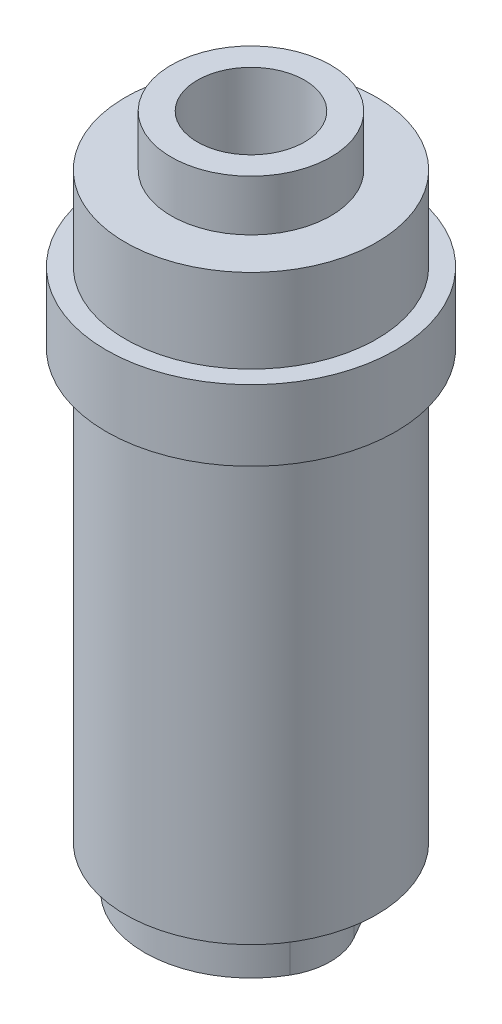
ISO-10303-21;
HEADER;
FILE_DESCRIPTION(('STEP AP214'),'2;1');
FILE_NAME('part.step','',(''),(''),'','','');
FILE_SCHEMA(('AUTOMOTIVE_DESIGN { 1 0 10303 214 1 1 1 1 }'));
ENDSEC;
DATA;
#1=APPLICATION_CONTEXT('core data for automotive mechanical design processes');
#2=APPLICATION_PROTOCOL_DEFINITION('international standard','automotive_design',2000,#1);
#3=PRODUCT_CONTEXT('',#1,'mechanical');
#4=PRODUCT('Part','Part','',(#3));
#5=PRODUCT_RELATED_PRODUCT_CATEGORY('part','',(#4));
#6=PRODUCT_DEFINITION_FORMATION('','',#4);
#7=PRODUCT_DEFINITION_CONTEXT('part definition',#1,'design');
#8=PRODUCT_DEFINITION('design','',#6,#7);
#9=PRODUCT_DEFINITION_SHAPE('','',#8);
#10=(LENGTH_UNIT() NAMED_UNIT(*) SI_UNIT(.MILLI.,.METRE.));
#11=(NAMED_UNIT(*) PLANE_ANGLE_UNIT() SI_UNIT($,.RADIAN.));
#12=(NAMED_UNIT(*) SI_UNIT($,.STERADIAN.) SOLID_ANGLE_UNIT());
#13=UNCERTAINTY_MEASURE_WITH_UNIT(LENGTH_MEASURE(1.E-05),#10,'distance_accuracy_value','');
#14=(GEOMETRIC_REPRESENTATION_CONTEXT(3) GLOBAL_UNCERTAINTY_ASSIGNED_CONTEXT((#13)) GLOBAL_UNIT_ASSIGNED_CONTEXT((#10,
#11,#12)) REPRESENTATION_CONTEXT('',''));
#15=CARTESIAN_POINT('',(0.,0.,0.));
#16=DIRECTION('',(0.,0.,1.));
#17=DIRECTION('',(1.,0.,0.));
#18=AXIS2_PLACEMENT_3D('',#15,#16,#17);
#19=CARTESIAN_POINT('',(-7.449199986,0.,0.));
#20=DIRECTION('',(0.,1.,0.));
#21=DIRECTION('',(1.,0.,0.));
#22=AXIS2_PLACEMENT_3D('',#19,#20,#21);
#23=PLANE('',#22);
#24=CARTESIAN_POINT('',(0.,0.,0.));
#25=DIRECTION('',(0.,-1.,0.));
#26=DIRECTION('',(0.,0.,-1.));
#27=AXIS2_PLACEMENT_3D('',#24,#25,#26);
#28=CIRCLE('',#27,3.2639);
#29=CARTESIAN_POINT('',(0.,0.,-3.2639));
#30=VERTEX_POINT('',#29);
#31=EDGE_CURVE('E187',#30,#30,#28,.T.);
#32=ORIENTED_EDGE('',*,*,#31,.F.);
#33=EDGE_LOOP('',(#32));
#34=FACE_BOUND('',#33,.T.);
#35=CARTESIAN_POINT('',(0.,0.,-2.54));
#36=DIRECTION('',(0.,-1.,0.));
#37=DIRECTION('',(0.,0.,-1.));
#38=AXIS2_PLACEMENT_3D('',#35,#36,#37);
#39=CIRCLE('',#38,3.81);
#40=CARTESIAN_POINT('',(-3.29955678841871,0.,-4.445));
#41=VERTEX_POINT('',#40);
#42=CARTESIAN_POINT('',(3.29955678841871,0.,-4.445));
#43=VERTEX_POINT('',#42);
#44=EDGE_CURVE('E74',#41,#43,#39,.T.);
#45=ORIENTED_EDGE('',*,*,#44,.T.);
#46=DIRECTION('',(0.5,0.,0.866025403784439));
#47=VECTOR('',#46,1.);
#48=CARTESIAN_POINT('',(3.29955678841871,0.,-4.445));
#49=LINE('',#48,#47);
#50=CARTESIAN_POINT('',(5.49926131403119,0.,-0.635));
#51=VERTEX_POINT('',#50);
#52=EDGE_CURVE('E11',#43,#51,#49,.T.);
#53=ORIENTED_EDGE('',*,*,#52,.T.);
#54=CARTESIAN_POINT('',(2.19970452561247,0.,1.27));
#55=DIRECTION('',(0.,-1.,0.));
#56=DIRECTION('',(0.,0.,-1.));
#57=AXIS2_PLACEMENT_3D('',#54,#55,#56);
#58=CIRCLE('',#57,3.81);
#59=CARTESIAN_POINT('',(5.49926131403119,0.,3.175));
#60=VERTEX_POINT('',#59);
#61=EDGE_CURVE('E46',#51,#60,#58,.T.);
#62=ORIENTED_EDGE('',*,*,#61,.T.);
#63=CARTESIAN_POINT('',(0.,0.,0.));
#64=DIRECTION('',(0.,-1.,0.));
#65=DIRECTION('',(0.,0.,-1.));
#66=AXIS2_PLACEMENT_3D('',#63,#64,#65);
#67=CIRCLE('',#66,6.35);
#68=CARTESIAN_POINT('',(-5.49926131403119,0.,3.175));
#69=VERTEX_POINT('',#68);
#70=EDGE_CURVE('E104',#60,#69,#67,.T.);
#71=ORIENTED_EDGE('',*,*,#70,.T.);
#72=CARTESIAN_POINT('',(-2.19970452561247,0.,1.27));
#73=DIRECTION('',(0.,-1.,0.));
#74=DIRECTION('',(0.,0.,-1.));
#75=AXIS2_PLACEMENT_3D('',#72,#73,#74);
#76=CIRCLE('',#75,3.81);
#77=CARTESIAN_POINT('',(-5.49926131403119,0.,-0.635));
#78=VERTEX_POINT('',#77);
#79=EDGE_CURVE('E85',#69,#78,#76,.T.);
#80=ORIENTED_EDGE('',*,*,#79,.T.);
#81=DIRECTION('',(0.5,0.,-0.866025403784439));
#82=VECTOR('',#81,1.);
#83=CARTESIAN_POINT('',(-5.49926131403119,0.,-0.635));
#84=LINE('',#83,#82);
#85=EDGE_CURVE('E160',#78,#41,#84,.T.);
#86=ORIENTED_EDGE('',*,*,#85,.T.);
#87=EDGE_LOOP('',(#45,#53,#62,#71,#80,#86));
#88=FACE_BOUND('',#87,.T.);
#89=ADVANCED_FACE('F16',(#34,#88),#23,.F.);
#90=CARTESIAN_POINT('',(-2.5527,6.35,0.));
#91=DIRECTION('',(0.,1.,0.));
#92=DIRECTION('',(1.,0.,0.));
#93=AXIS2_PLACEMENT_3D('',#90,#91,#92);
#94=PLANE('',#93);
#95=CARTESIAN_POINT('',(0.,6.35,0.));
#96=DIRECTION('',(0.,-1.,0.));
#97=DIRECTION('',(0.,0.,-1.));
#98=AXIS2_PLACEMENT_3D('',#95,#96,#97);
#99=CIRCLE('',#98,2.5527);
#100=CARTESIAN_POINT('',(0.,6.35,-2.5527));
#101=VERTEX_POINT('',#100);
#102=EDGE_CURVE('E200',#101,#101,#99,.T.);
#103=ORIENTED_EDGE('',*,*,#102,.F.);
#104=EDGE_LOOP('',(#103));
#105=FACE_BOUND('',#104,.T.);
#106=CARTESIAN_POINT('',(0.,6.35,0.));
#107=DIRECTION('',(0.,-1.,0.));
#108=DIRECTION('',(0.,0.,-1.));
#109=AXIS2_PLACEMENT_3D('',#106,#107,#108);
#110=CIRCLE('',#109,3.2639);
#111=CARTESIAN_POINT('',(0.,6.35,-3.2639));
#112=VERTEX_POINT('',#111);
#113=EDGE_CURVE('E195',#112,#112,#110,.T.);
#114=ORIENTED_EDGE('',*,*,#113,.T.);
#115=EDGE_LOOP('',(#114));
#116=FACE_BOUND('',#115,.T.);
#117=ADVANCED_FACE('F177',(#105,#116),#94,.F.);
#118=CARTESIAN_POINT('',(3.29955678841871,23.6095192980614,-4.445));
#119=DIRECTION('',(0.866025403784439,0.,-0.5));
#120=DIRECTION('',(0.,-1.,0.));
#121=AXIS2_PLACEMENT_3D('',#118,#119,#120);
#122=PLANE('',#121);
#123=DIRECTION('',(0.5,0.,0.866025403784439));
#124=VECTOR('',#123,1.);
#125=CARTESIAN_POINT('',(3.29955678841871,2.54,-4.445));
#126=LINE('',#125,#124);
#127=CARTESIAN_POINT('',(3.29955678841871,2.54,-4.445));
#128=VERTEX_POINT('',#127);
#129=CARTESIAN_POINT('',(5.49926131403119,2.54,-0.635));
#130=VERTEX_POINT('',#129);
#131=EDGE_CURVE('E155',#128,#130,#126,.T.);
#132=ORIENTED_EDGE('',*,*,#131,.T.);
#133=DIRECTION('',(0.,-1.,0.));
#134=VECTOR('',#133,1.);
#135=CARTESIAN_POINT('',(5.49926131403119,23.6095192980614,-0.635));
#136=LINE('',#135,#134);
#137=EDGE_CURVE('E24',#130,#51,#136,.T.);
#138=ORIENTED_EDGE('',*,*,#137,.T.);
#139=ORIENTED_EDGE('',*,*,#52,.F.);
#140=DIRECTION('',(0.,-1.,0.));
#141=VECTOR('',#140,1.);
#142=CARTESIAN_POINT('',(3.29955678841871,23.6095192980614,-4.445));
#143=LINE('',#142,#141);
#144=EDGE_CURVE('E156',#128,#43,#143,.T.);
#145=ORIENTED_EDGE('',*,*,#144,.F.);
#146=EDGE_LOOP('',(#132,#138,#139,#145));
#147=FACE_BOUND('',#146,.T.);
#148=ADVANCED_FACE('F172',(#147),#122,.T.);
#149=CARTESIAN_POINT('',(2.19970452561247,23.6095192980614,1.27));
#150=DIRECTION('',(0.,-1.,0.));
#151=DIRECTION('',(0.,0.,-1.));
#152=AXIS2_PLACEMENT_3D('',#149,#150,#151);
#153=CYLINDRICAL_SURFACE('',#152,3.81);
#154=CARTESIAN_POINT('',(2.19970452561247,2.54,1.27));
#155=DIRECTION('',(0.,-1.,0.));
#156=DIRECTION('',(0.,0.,1.));
#157=AXIS2_PLACEMENT_3D('',#154,#155,#156);
#158=CIRCLE('',#157,3.81);
#159=CARTESIAN_POINT('',(5.49926131403119,2.54,3.175));
#160=VERTEX_POINT('',#159);
#161=EDGE_CURVE('E113',#130,#160,#158,.T.);
#162=ORIENTED_EDGE('',*,*,#161,.T.);
#163=DIRECTION('',(0.,-1.,0.));
#164=VECTOR('',#163,1.);
#165=CARTESIAN_POINT('',(5.49926131403119,23.6095192980614,3.175));
#166=LINE('',#165,#164);
#167=EDGE_CURVE('E109',#160,#60,#166,.T.);
#168=ORIENTED_EDGE('',*,*,#167,.T.);
#169=ORIENTED_EDGE('',*,*,#61,.F.);
#170=ORIENTED_EDGE('',*,*,#137,.F.);
#171=EDGE_LOOP('',(#162,#168,#169,#170));
#172=FACE_BOUND('',#171,.T.);
#173=ADVANCED_FACE('F180',(#172),#153,.T.);
#174=CARTESIAN_POINT('',(0.,23.6095192980614,0.));
#175=DIRECTION('',(0.,-1.,0.));
#176=DIRECTION('',(0.,0.,-1.));
#177=AXIS2_PLACEMENT_3D('',#174,#175,#176);
#178=CYLINDRICAL_SURFACE('',#177,6.35);
#179=CARTESIAN_POINT('',(0.,2.54,0.));
#180=DIRECTION('',(0.,-1.,0.));
#181=DIRECTION('',(0.,0.,1.));
#182=AXIS2_PLACEMENT_3D('',#179,#180,#181);
#183=CIRCLE('',#182,6.35);
#184=CARTESIAN_POINT('',(-5.49926131403119,2.54,3.175));
#185=VERTEX_POINT('',#184);
#186=EDGE_CURVE('E107',#160,#185,#183,.T.);
#187=ORIENTED_EDGE('',*,*,#186,.T.);
#188=DIRECTION('',(0.,-1.,0.));
#189=VECTOR('',#188,1.);
#190=CARTESIAN_POINT('',(-5.49926131403119,23.6095192980614,3.175));
#191=LINE('',#190,#189);
#192=EDGE_CURVE('E96',#185,#69,#191,.T.);
#193=ORIENTED_EDGE('',*,*,#192,.T.);
#194=ORIENTED_EDGE('',*,*,#70,.F.);
#195=ORIENTED_EDGE('',*,*,#167,.F.);
#196=EDGE_LOOP('',(#187,#193,#194,#195));
#197=FACE_BOUND('',#196,.T.);
#198=ADVANCED_FACE('F108',(#197),#178,.T.);
#199=CARTESIAN_POINT('',(-2.19970452561247,23.6095192980614,1.27));
#200=DIRECTION('',(0.,-1.,0.));
#201=DIRECTION('',(0.,0.,-1.));
#202=AXIS2_PLACEMENT_3D('',#199,#200,#201);
#203=CYLINDRICAL_SURFACE('',#202,3.81);
#204=CARTESIAN_POINT('',(-2.19970452561247,2.54,1.27));
#205=DIRECTION('',(0.,-1.,0.));
#206=DIRECTION('',(0.,0.,1.));
#207=AXIS2_PLACEMENT_3D('',#204,#205,#206);
#208=CIRCLE('',#207,3.81);
#209=CARTESIAN_POINT('',(-5.49926131403119,2.54,-0.635));
#210=VERTEX_POINT('',#209);
#211=EDGE_CURVE('E99',#185,#210,#208,.T.);
#212=ORIENTED_EDGE('',*,*,#211,.T.);
#213=DIRECTION('',(0.,-1.,0.));
#214=VECTOR('',#213,1.);
#215=CARTESIAN_POINT('',(-5.49926131403119,23.6095192980614,-0.635));
#216=LINE('',#215,#214);
#217=EDGE_CURVE('E159',#210,#78,#216,.T.);
#218=ORIENTED_EDGE('',*,*,#217,.T.);
#219=ORIENTED_EDGE('',*,*,#79,.F.);
#220=ORIENTED_EDGE('',*,*,#192,.F.);
#221=EDGE_LOOP('',(#212,#218,#219,#220));
#222=FACE_BOUND('',#221,.T.);
#223=ADVANCED_FACE('F98',(#222),#203,.T.);
#224=CARTESIAN_POINT('',(-5.49926131403119,23.6095192980614,-0.635));
#225=DIRECTION('',(-0.866025403784439,0.,-0.5));
#226=DIRECTION('',(-0.5,0.,0.866025403784439));
#227=AXIS2_PLACEMENT_3D('',#224,#225,#226);
#228=PLANE('',#227);
#229=DIRECTION('',(0.5,0.,-0.866025403784439));
#230=VECTOR('',#229,1.);
#231=CARTESIAN_POINT('',(-5.49926131403119,2.54,-0.635));
#232=LINE('',#231,#230);
#233=CARTESIAN_POINT('',(-3.29955678841871,2.54,-4.445));
#234=VERTEX_POINT('',#233);
#235=EDGE_CURVE('E120',#210,#234,#232,.T.);
#236=ORIENTED_EDGE('',*,*,#235,.T.);
#237=DIRECTION('',(0.,-1.,0.));
#238=VECTOR('',#237,1.);
#239=CARTESIAN_POINT('',(-3.29955678841871,23.6095192980614,-4.445));
#240=LINE('',#239,#238);
#241=EDGE_CURVE('E206',#234,#41,#240,.T.);
#242=ORIENTED_EDGE('',*,*,#241,.T.);
#243=ORIENTED_EDGE('',*,*,#85,.F.);
#244=ORIENTED_EDGE('',*,*,#217,.F.);
#245=EDGE_LOOP('',(#236,#242,#243,#244));
#246=FACE_BOUND('',#245,.T.);
#247=ADVANCED_FACE('F242',(#246),#228,.T.);
#248=CARTESIAN_POINT('',(-4.7625,37.285900282,0.));
#249=DIRECTION('',(0.,-1.,0.));
#250=DIRECTION('',(0.,0.,-1.));
#251=AXIS2_PLACEMENT_3D('',#248,#249,#250);
#252=PLANE('',#251);
#253=CARTESIAN_POINT('',(0.,37.285900282,0.));
#254=DIRECTION('',(0.,-1.,0.));
#255=DIRECTION('',(0.,0.,-1.));
#256=AXIS2_PLACEMENT_3D('',#253,#254,#255);
#257=CIRCLE('',#256,4.7625);
#258=CARTESIAN_POINT('',(0.,37.285900282,-4.7625));
#259=VERTEX_POINT('',#258);
#260=EDGE_CURVE('E126',#259,#259,#257,.T.);
#261=ORIENTED_EDGE('',*,*,#260,.T.);
#262=EDGE_LOOP('',(#261));
#263=FACE_BOUND('',#262,.T.);
#264=CARTESIAN_POINT('',(0.,37.285900282,0.));
#265=DIRECTION('',(0.,-1.,0.));
#266=DIRECTION('',(0.,0.,-1.));
#267=AXIS2_PLACEMENT_3D('',#264,#265,#266);
#268=CIRCLE('',#267,7.499999986);
#269=CARTESIAN_POINT('',(0.,37.285900282,-7.499999986));
#270=VERTEX_POINT('',#269);
#271=EDGE_CURVE('E212',#270,#270,#268,.T.);
#272=ORIENTED_EDGE('',*,*,#271,.F.);
#273=EDGE_LOOP('',(#272));
#274=FACE_BOUND('',#273,.T.);
#275=ADVANCED_FACE('F582',(#263,#274),#252,.F.);
#276=CARTESIAN_POINT('',(-8.636,32.285900376,0.));
#277=DIRECTION('',(0.,-1.,0.));
#278=DIRECTION('',(0.,0.,-1.));
#279=AXIS2_PLACEMENT_3D('',#276,#277,#278);
#280=PLANE('',#279);
#281=CARTESIAN_POINT('',(0.,32.285900376,0.));
#282=DIRECTION('',(0.,-1.,0.));
#283=DIRECTION('',(0.,0.,-1.));
#284=AXIS2_PLACEMENT_3D('',#281,#282,#283);
#285=CIRCLE('',#284,7.499999986);
#286=CARTESIAN_POINT('',(0.,32.285900376,-7.499999986));
#287=VERTEX_POINT('',#286);
#288=EDGE_CURVE('E219',#287,#287,#285,.T.);
#289=ORIENTED_EDGE('',*,*,#288,.T.);
#290=EDGE_LOOP('',(#289));
#291=FACE_BOUND('',#290,.T.);
#292=CARTESIAN_POINT('',(0.,32.285900376,0.));
#293=DIRECTION('',(0.,-1.,0.));
#294=DIRECTION('',(0.,0.,-1.));
#295=AXIS2_PLACEMENT_3D('',#292,#293,#294);
#296=CIRCLE('',#295,8.636);
#297=CARTESIAN_POINT('',(0.,32.285900376,-8.636));
#298=VERTEX_POINT('',#297);
#299=EDGE_CURVE('E221',#298,#298,#296,.T.);
#300=ORIENTED_EDGE('',*,*,#299,.F.);
#301=EDGE_LOOP('',(#300));
#302=FACE_BOUND('',#301,.T.);
#303=ADVANCED_FACE('F531',(#291,#302),#280,.F.);
#304=CARTESIAN_POINT('',(-8.636,28.067,0.));
#305=DIRECTION('',(0.,1.,0.));
#306=DIRECTION('',(1.,0.,0.));
#307=AXIS2_PLACEMENT_3D('',#304,#305,#306);
#308=PLANE('',#307);
#309=CARTESIAN_POINT('',(0.,28.067,0.));
#310=DIRECTION('',(0.,-1.,0.));
#311=DIRECTION('',(0.,0.,-1.));
#312=AXIS2_PLACEMENT_3D('',#309,#310,#311);
#313=CIRCLE('',#312,7.499999986);
#314=CARTESIAN_POINT('',(0.,28.067,-7.499999986));
#315=VERTEX_POINT('',#314);
#316=EDGE_CURVE('E235',#315,#315,#313,.T.);
#317=ORIENTED_EDGE('',*,*,#316,.F.);
#318=EDGE_LOOP('',(#317));
#319=FACE_BOUND('',#318,.T.);
#320=CARTESIAN_POINT('',(0.,28.067,0.));
#321=DIRECTION('',(0.,-1.,0.));
#322=DIRECTION('',(0.,0.,-1.));
#323=AXIS2_PLACEMENT_3D('',#320,#321,#322);
#324=CIRCLE('',#323,8.636);
#325=CARTESIAN_POINT('',(0.,28.067,-8.636));
#326=VERTEX_POINT('',#325);
#327=EDGE_CURVE('E229',#326,#326,#324,.T.);
#328=ORIENTED_EDGE('',*,*,#327,.T.);
#329=EDGE_LOOP('',(#328));
#330=FACE_BOUND('',#329,.T.);
#331=ADVANCED_FACE('F530',(#319,#330),#308,.F.);
#332=CARTESIAN_POINT('',(-7.499999986,2.54,0.));
#333=DIRECTION('',(0.,1.,0.));
#334=DIRECTION('',(1.,0.,0.));
#335=AXIS2_PLACEMENT_3D('',#332,#333,#334);
#336=PLANE('',#335);
#337=ORIENTED_EDGE('',*,*,#235,.F.);
#338=ORIENTED_EDGE('',*,*,#211,.F.);
#339=ORIENTED_EDGE('',*,*,#186,.F.);
#340=ORIENTED_EDGE('',*,*,#161,.F.);
#341=ORIENTED_EDGE('',*,*,#131,.F.);
#342=CARTESIAN_POINT('',(0.,2.54,-2.54));
#343=DIRECTION('',(0.,-1.,0.));
#344=DIRECTION('',(0.,0.,1.));
#345=AXIS2_PLACEMENT_3D('',#342,#343,#344);
#346=CIRCLE('',#345,3.81);
#347=EDGE_CURVE('E210',#234,#128,#346,.T.);
#348=ORIENTED_EDGE('',*,*,#347,.F.);
#349=EDGE_LOOP('',(#337,#338,#339,#340,#341,#348));
#350=FACE_BOUND('',#349,.T.);
#351=CARTESIAN_POINT('',(0.,2.54,0.));
#352=DIRECTION('',(0.,-1.,0.));
#353=DIRECTION('',(0.,0.,-1.));
#354=AXIS2_PLACEMENT_3D('',#351,#352,#353);
#355=CIRCLE('',#354,7.499999986);
#356=CARTESIAN_POINT('',(0.,2.54,-7.499999986));
#357=VERTEX_POINT('',#356);
#358=EDGE_CURVE('E131',#357,#357,#355,.T.);
#359=ORIENTED_EDGE('',*,*,#358,.T.);
#360=EDGE_LOOP('',(#359));
#361=FACE_BOUND('',#360,.T.);
#362=ADVANCED_FACE('F117',(#350,#361),#336,.F.);
#363=CARTESIAN_POINT('',(-3.2004,27.621700408,0.));
#364=DIRECTION('',(0.,-1.,0.));
#365=DIRECTION('',(0.,0.,-1.));
#366=AXIS2_PLACEMENT_3D('',#363,#364,#365);
#367=PLANE('',#366);
#368=CARTESIAN_POINT('',(0.,27.621700408,0.));
#369=DIRECTION('',(0.,-1.,0.));
#370=DIRECTION('',(0.,0.,-1.));
#371=AXIS2_PLACEMENT_3D('',#368,#369,#370);
#372=CIRCLE('',#371,2.5527);
#373=CARTESIAN_POINT('',(0.,27.621700408,-2.5527));
#374=VERTEX_POINT('',#373);
#375=EDGE_CURVE('E191',#374,#374,#372,.T.);
#376=ORIENTED_EDGE('',*,*,#375,.T.);
#377=EDGE_LOOP('',(#376));
#378=FACE_BOUND('',#377,.T.);
#379=CARTESIAN_POINT('',(0.,27.621700408,0.));
#380=DIRECTION('',(0.,-1.,0.));
#381=DIRECTION('',(0.,0.,-1.));
#382=AXIS2_PLACEMENT_3D('',#379,#380,#381);
#383=CIRCLE('',#382,3.2004);
#384=CARTESIAN_POINT('',(0.,27.621700408,-3.2004));
#385=VERTEX_POINT('',#384);
#386=EDGE_CURVE('E140',#385,#385,#383,.T.);
#387=ORIENTED_EDGE('',*,*,#386,.F.);
#388=EDGE_LOOP('',(#387));
#389=FACE_BOUND('',#388,.T.);
#390=ADVANCED_FACE('F553',(#378,#389),#367,.F.);
#391=CARTESIAN_POINT('',(-4.7625,40.321700408,0.));
#392=DIRECTION('',(0.,-1.,0.));
#393=DIRECTION('',(0.,0.,-1.));
#394=AXIS2_PLACEMENT_3D('',#391,#392,#393);
#395=PLANE('',#394);
#396=CARTESIAN_POINT('',(0.,40.321700408,0.));
#397=DIRECTION('',(0.,-1.,0.));
#398=DIRECTION('',(0.,0.,-1.));
#399=AXIS2_PLACEMENT_3D('',#396,#397,#398);
#400=CIRCLE('',#399,3.2004);
#401=CARTESIAN_POINT('',(0.,40.321700408,-3.2004));
#402=VERTEX_POINT('',#401);
#403=EDGE_CURVE('E132',#402,#402,#400,.T.);
#404=ORIENTED_EDGE('',*,*,#403,.T.);
#405=EDGE_LOOP('',(#404));
#406=FACE_BOUND('',#405,.T.);
#407=CARTESIAN_POINT('',(0.,40.321700408,0.));
#408=DIRECTION('',(0.,-1.,0.));
#409=DIRECTION('',(0.,0.,-1.));
#410=AXIS2_PLACEMENT_3D('',#407,#408,#409);
#411=CIRCLE('',#410,4.7625);
#412=CARTESIAN_POINT('',(0.,40.321700408,-4.7625));
#413=VERTEX_POINT('',#412);
#414=EDGE_CURVE('E143',#413,#413,#411,.T.);
#415=ORIENTED_EDGE('',*,*,#414,.F.);
#416=EDGE_LOOP('',(#415));
#417=FACE_BOUND('',#416,.T.);
#418=ADVANCED_FACE('F297',(#406,#417),#395,.F.);
#419=CARTESIAN_POINT('',(0.,19.05,0.));
#420=DIRECTION('',(0.,-1.,0.));
#421=DIRECTION('',(0.,0.,-1.));
#422=AXIS2_PLACEMENT_3D('',#419,#420,#421);
#423=CYLINDRICAL_SURFACE('',#422,4.7625);
#424=ORIENTED_EDGE('',*,*,#260,.F.);
#425=EDGE_LOOP('',(#424));
#426=FACE_BOUND('',#425,.T.);
#427=ORIENTED_EDGE('',*,*,#414,.T.);
#428=EDGE_LOOP('',(#427));
#429=FACE_BOUND('',#428,.T.);
#430=ADVANCED_FACE('F295',(#426,#429),#423,.T.);
#431=CARTESIAN_POINT('',(0.,19.05,0.));
#432=DIRECTION('',(0.,-1.,0.));
#433=DIRECTION('',(0.,0.,-1.));
#434=AXIS2_PLACEMENT_3D('',#431,#432,#433);
#435=CYLINDRICAL_SURFACE('',#434,3.2004);
#436=ORIENTED_EDGE('',*,*,#386,.T.);
#437=EDGE_LOOP('',(#436));
#438=FACE_BOUND('',#437,.T.);
#439=ORIENTED_EDGE('',*,*,#403,.F.);
#440=EDGE_LOOP('',(#439));
#441=FACE_BOUND('',#440,.T.);
#442=ADVANCED_FACE('F300',(#438,#441),#435,.F.);
#443=CARTESIAN_POINT('',(0.,19.05,0.));
#444=DIRECTION('',(0.,-1.,0.));
#445=DIRECTION('',(0.,0.,-1.));
#446=AXIS2_PLACEMENT_3D('',#443,#444,#445);
#447=CYLINDRICAL_SURFACE('',#446,7.499999986);
#448=ORIENTED_EDGE('',*,*,#358,.F.);
#449=EDGE_LOOP('',(#448));
#450=FACE_BOUND('',#449,.T.);
#451=ORIENTED_EDGE('',*,*,#316,.T.);
#452=EDGE_LOOP('',(#451));
#453=FACE_BOUND('',#452,.T.);
#454=ADVANCED_FACE('F311',(#450,#453),#447,.T.);
#455=CARTESIAN_POINT('',(0.,19.05,0.));
#456=DIRECTION('',(0.,-1.,0.));
#457=DIRECTION('',(0.,0.,-1.));
#458=AXIS2_PLACEMENT_3D('',#455,#456,#457);
#459=CYLINDRICAL_SURFACE('',#458,8.636);
#460=ORIENTED_EDGE('',*,*,#327,.F.);
#461=EDGE_LOOP('',(#460));
#462=FACE_BOUND('',#461,.T.);
#463=ORIENTED_EDGE('',*,*,#299,.T.);
#464=EDGE_LOOP('',(#463));
#465=FACE_BOUND('',#464,.T.);
#466=ADVANCED_FACE('F324',(#462,#465),#459,.T.);
#467=CARTESIAN_POINT('',(0.,19.05,0.));
#468=DIRECTION('',(0.,-1.,0.));
#469=DIRECTION('',(0.,0.,-1.));
#470=AXIS2_PLACEMENT_3D('',#467,#468,#469);
#471=CYLINDRICAL_SURFACE('',#470,7.499999986);
#472=ORIENTED_EDGE('',*,*,#288,.F.);
#473=EDGE_LOOP('',(#472));
#474=FACE_BOUND('',#473,.T.);
#475=ORIENTED_EDGE('',*,*,#271,.T.);
#476=EDGE_LOOP('',(#475));
#477=FACE_BOUND('',#476,.T.);
#478=ADVANCED_FACE('F337',(#474,#477),#471,.T.);
#479=CARTESIAN_POINT('',(0.,23.6095192980614,-2.54));
#480=DIRECTION('',(0.,-1.,0.));
#481=DIRECTION('',(0.,0.,-1.));
#482=AXIS2_PLACEMENT_3D('',#479,#480,#481);
#483=CYLINDRICAL_SURFACE('',#482,3.81);
#484=ORIENTED_EDGE('',*,*,#347,.T.);
#485=ORIENTED_EDGE('',*,*,#144,.T.);
#486=ORIENTED_EDGE('',*,*,#44,.F.);
#487=ORIENTED_EDGE('',*,*,#241,.F.);
#488=EDGE_LOOP('',(#484,#485,#486,#487));
#489=FACE_BOUND('',#488,.T.);
#490=ADVANCED_FACE('F237',(#489),#483,.T.);
#491=CARTESIAN_POINT('',(0.,19.05,0.));
#492=DIRECTION('',(0.,-1.,0.));
#493=DIRECTION('',(0.,0.,-1.));
#494=AXIS2_PLACEMENT_3D('',#491,#492,#493);
#495=CYLINDRICAL_SURFACE('',#494,2.5527);
#496=ORIENTED_EDGE('',*,*,#102,.T.);
#497=EDGE_LOOP('',(#496));
#498=FACE_BOUND('',#497,.T.);
#499=ORIENTED_EDGE('',*,*,#375,.F.);
#500=EDGE_LOOP('',(#499));
#501=FACE_BOUND('',#500,.T.);
#502=ADVANCED_FACE('F359',(#498,#501),#495,.F.);
#503=CARTESIAN_POINT('',(0.,19.05,0.));
#504=DIRECTION('',(0.,-1.,0.));
#505=DIRECTION('',(0.,0.,-1.));
#506=AXIS2_PLACEMENT_3D('',#503,#504,#505);
#507=CYLINDRICAL_SURFACE('',#506,3.2639);
#508=ORIENTED_EDGE('',*,*,#31,.T.);
#509=EDGE_LOOP('',(#508));
#510=FACE_BOUND('',#509,.T.);
#511=ORIENTED_EDGE('',*,*,#113,.F.);
#512=EDGE_LOOP('',(#511));
#513=FACE_BOUND('',#512,.T.);
#514=ADVANCED_FACE('F371',(#510,#513),#507,.F.);
#515=CLOSED_SHELL('',(#89,#117,#148,#173,#198,#223,#247,#275,#303,#331,#362,#390,#418,#430,#442,
#454,#466,#478,#490,#502,#514));
#516=MANIFOLD_SOLID_BREP('B1',#515);
#517=ADVANCED_BREP_SHAPE_REPRESENTATION('',(#18,#516),#14);
#518=SHAPE_DEFINITION_REPRESENTATION(#9,#517);
ENDSEC;
END-ISO-10303-21;
